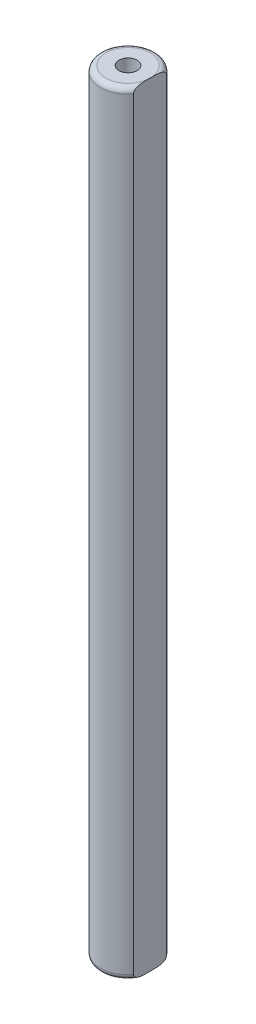
ISO-10303-21;
HEADER;
FILE_DESCRIPTION(('STEP AP214'),'2;1');
FILE_NAME('part.step','',(''),(''),'','','');
FILE_SCHEMA(('AUTOMOTIVE_DESIGN { 1 0 10303 214 1 1 1 1 }'));
ENDSEC;
DATA;
#1=APPLICATION_CONTEXT('core data for automotive mechanical design processes');
#2=APPLICATION_PROTOCOL_DEFINITION('international standard','automotive_design',2000,#1);
#3=PRODUCT_CONTEXT('',#1,'mechanical');
#4=PRODUCT('Part','Part','',(#3));
#5=PRODUCT_RELATED_PRODUCT_CATEGORY('part','',(#4));
#6=PRODUCT_DEFINITION_FORMATION('','',#4);
#7=PRODUCT_DEFINITION_CONTEXT('part definition',#1,'design');
#8=PRODUCT_DEFINITION('design','',#6,#7);
#9=PRODUCT_DEFINITION_SHAPE('','',#8);
#10=(LENGTH_UNIT() NAMED_UNIT(*) SI_UNIT(.MILLI.,.METRE.));
#11=(NAMED_UNIT(*) PLANE_ANGLE_UNIT() SI_UNIT($,.RADIAN.));
#12=(NAMED_UNIT(*) SI_UNIT($,.STERADIAN.) SOLID_ANGLE_UNIT());
#13=UNCERTAINTY_MEASURE_WITH_UNIT(LENGTH_MEASURE(1.E-05),#10,'distance_accuracy_value','');
#14=(GEOMETRIC_REPRESENTATION_CONTEXT(3) GLOBAL_UNCERTAINTY_ASSIGNED_CONTEXT((#13)) GLOBAL_UNIT_ASSIGNED_CONTEXT((#10,
#11,#12)) REPRESENTATION_CONTEXT('',''));
#15=CARTESIAN_POINT('',(0.,0.,0.));
#16=DIRECTION('',(0.,0.,1.));
#17=DIRECTION('',(1.,0.,0.));
#18=AXIS2_PLACEMENT_3D('',#15,#16,#17);
#19=CARTESIAN_POINT('',(0.,-35.15,0.));
#20=DIRECTION('',(0.,-1.,0.));
#21=DIRECTION('',(0.,0.,1.));
#22=AXIS2_PLACEMENT_3D('',#19,#20,#21);
#23=PLANE('',#22);
#24=CARTESIAN_POINT('',(0.,-35.15,0.));
#25=DIRECTION('',(0.,-1.,0.));
#26=DIRECTION('',(0.,0.,-1.));
#27=AXIS2_PLACEMENT_3D('',#24,#25,#26);
#28=CIRCLE('',#27,2.);
#29=CARTESIAN_POINT('',(2.,-35.15,0.));
#30=VERTEX_POINT('',#29);
#31=EDGE_CURVE('E11',#30,#30,#28,.T.);
#32=ORIENTED_EDGE('',*,*,#31,.T.);
#33=EDGE_LOOP('',(#32));
#34=FACE_BOUND('',#33,.T.);
#35=CARTESIAN_POINT('',(0.,-35.15,0.));
#36=DIRECTION('',(0.,1.,0.));
#37=DIRECTION('',(0.,0.,1.));
#38=AXIS2_PLACEMENT_3D('',#35,#36,#37);
#39=CIRCLE('',#38,0.825);
#40=CARTESIAN_POINT('',(0.,-35.15,0.825));
#41=VERTEX_POINT('',#40);
#42=EDGE_CURVE('E135',#41,#41,#39,.T.);
#43=ORIENTED_EDGE('',*,*,#42,.T.);
#44=EDGE_LOOP('',(#43));
#45=FACE_BOUND('',#44,.T.);
#46=ADVANCED_FACE('F35',(#34,#45),#23,.T.);
#47=CARTESIAN_POINT('',(0.,35.15,0.));
#48=DIRECTION('',(0.,-1.,0.));
#49=DIRECTION('',(0.,0.,-1.));
#50=AXIS2_PLACEMENT_3D('',#47,#48,#49);
#51=CYLINDRICAL_SURFACE('',#50,2.5);
#52=DIRECTION('',(0.,1.,0.));
#53=VECTOR('',#52,1.);
#54=CARTESIAN_POINT('',(2.,0.,-1.5));
#55=LINE('',#54,#53);
#56=CARTESIAN_POINT('',(2.,-34.65,-1.5));
#57=VERTEX_POINT('',#56);
#58=CARTESIAN_POINT('',(2.,34.65,-1.5));
#59=VERTEX_POINT('',#58);
#60=EDGE_CURVE('E82',#57,#59,#55,.T.);
#61=ORIENTED_EDGE('',*,*,#60,.F.);
#62=CARTESIAN_POINT('',(0.,-34.65,0.));
#63=DIRECTION('',(0.,-1.,0.));
#64=DIRECTION('',(0.,0.,-1.));
#65=AXIS2_PLACEMENT_3D('',#62,#63,#64);
#66=CIRCLE('',#65,2.5);
#67=CARTESIAN_POINT('',(2.,-34.65,1.5));
#68=VERTEX_POINT('',#67);
#69=EDGE_CURVE('E118',#57,#68,#66,.F.);
#70=ORIENTED_EDGE('',*,*,#69,.T.);
#71=DIRECTION('',(0.,1.,0.));
#72=VECTOR('',#71,1.);
#73=CARTESIAN_POINT('',(2.,0.,1.5));
#74=LINE('',#73,#72);
#75=CARTESIAN_POINT('',(2.,34.65,1.5));
#76=VERTEX_POINT('',#75);
#77=EDGE_CURVE('E123',#68,#76,#74,.T.);
#78=ORIENTED_EDGE('',*,*,#77,.T.);
#79=CARTESIAN_POINT('',(0.,34.65,0.));
#80=DIRECTION('',(0.,1.,0.));
#81=DIRECTION('',(0.,0.,1.));
#82=AXIS2_PLACEMENT_3D('',#79,#80,#81);
#83=CIRCLE('',#82,2.5);
#84=EDGE_CURVE('E77',#76,#59,#83,.F.);
#85=ORIENTED_EDGE('',*,*,#84,.T.);
#86=EDGE_LOOP('',(#61,#70,#78,#85));
#87=FACE_BOUND('',#86,.T.);
#88=ADVANCED_FACE('F154',(#87),#51,.T.);
#89=CARTESIAN_POINT('',(0.,35.15,0.));
#90=DIRECTION('',(0.,1.,0.));
#91=DIRECTION('',(0.,0.,1.));
#92=AXIS2_PLACEMENT_3D('',#89,#90,#91);
#93=PLANE('',#92);
#94=CARTESIAN_POINT('',(0.,35.15,0.));
#95=DIRECTION('',(0.,1.,0.));
#96=DIRECTION('',(0.,0.,1.));
#97=AXIS2_PLACEMENT_3D('',#94,#95,#96);
#98=CIRCLE('',#97,2.);
#99=CARTESIAN_POINT('',(2.,35.15,0.));
#100=VERTEX_POINT('',#99);
#101=EDGE_CURVE('E75',#100,#100,#98,.T.);
#102=ORIENTED_EDGE('',*,*,#101,.T.);
#103=EDGE_LOOP('',(#102));
#104=FACE_BOUND('',#103,.T.);
#105=CARTESIAN_POINT('',(0.,35.15,0.));
#106=DIRECTION('',(0.,1.,0.));
#107=DIRECTION('',(0.,0.,1.));
#108=AXIS2_PLACEMENT_3D('',#105,#106,#107);
#109=CIRCLE('',#108,0.825);
#110=CARTESIAN_POINT('',(0.,35.15,0.825));
#111=VERTEX_POINT('',#110);
#112=EDGE_CURVE('E90',#111,#111,#109,.T.);
#113=ORIENTED_EDGE('',*,*,#112,.F.);
#114=EDGE_LOOP('',(#113));
#115=FACE_BOUND('',#114,.T.);
#116=ADVANCED_FACE('F85',(#104,#115),#93,.T.);
#117=CARTESIAN_POINT('',(0.,30.15,0.));
#118=DIRECTION('',(0.,1.,0.));
#119=DIRECTION('',(0.,0.,1.));
#120=AXIS2_PLACEMENT_3D('',#117,#118,#119);
#121=CYLINDRICAL_SURFACE('',#120,0.825);
#122=CARTESIAN_POINT('',(0.,30.15,0.));
#123=DIRECTION('',(0.,1.,0.));
#124=DIRECTION('',(0.,0.,1.));
#125=AXIS2_PLACEMENT_3D('',#122,#123,#124);
#126=CIRCLE('',#125,0.825);
#127=CARTESIAN_POINT('',(0.,30.15,0.825));
#128=VERTEX_POINT('',#127);
#129=EDGE_CURVE('E87',#128,#128,#126,.T.);
#130=ORIENTED_EDGE('',*,*,#129,.F.);
#131=EDGE_LOOP('',(#130));
#132=FACE_BOUND('',#131,.T.);
#133=ORIENTED_EDGE('',*,*,#112,.T.);
#134=EDGE_LOOP('',(#133));
#135=FACE_BOUND('',#134,.T.);
#136=ADVANCED_FACE('F161',(#132,#135),#121,.F.);
#137=CARTESIAN_POINT('',(0.,30.15,0.));
#138=DIRECTION('',(0.,1.,0.));
#139=DIRECTION('',(0.,0.,1.));
#140=AXIS2_PLACEMENT_3D('',#137,#138,#139);
#141=PLANE('',#140);
#142=ORIENTED_EDGE('',*,*,#129,.T.);
#143=EDGE_LOOP('',(#142));
#144=FACE_BOUND('',#143,.T.);
#145=ADVANCED_FACE('F107',(#144),#141,.T.);
#146=CARTESIAN_POINT('',(2.,0.,-1.5));
#147=DIRECTION('',(-1.,0.,0.));
#148=DIRECTION('',(0.,0.,1.));
#149=AXIS2_PLACEMENT_3D('',#146,#147,#148);
#150=PLANE('',#149);
#151=ORIENTED_EDGE('',*,*,#77,.F.);
#152=CARTESIAN_POINT('',(2.,-34.65,1.5));
#153=CARTESIAN_POINT('',(2.,-34.6700065150284,1.50005508764519));
#154=CARTESIAN_POINT('',(2.,-34.6899505223803,1.49800297503596));
#155=CARTESIAN_POINT('',(2.,-34.7288908622129,1.49017103135305));
#156=CARTESIAN_POINT('',(2.,-34.747894786355,1.48442943896433));
#157=CARTESIAN_POINT('',(2.,-34.7845007170815,1.46971395516311));
#158=CARTESIAN_POINT('',(2.,-34.8021074472319,1.46075157527048));
#159=CARTESIAN_POINT('',(2.,-34.8357418270519,1.44018960181346));
#160=CARTESIAN_POINT('',(2.,-34.8517650844176,1.42858295243752));
#161=CARTESIAN_POINT('',(2.,-34.8889337995344,1.39760924057378));
#162=CARTESIAN_POINT('',(2.,-34.9091275913188,1.37710380043444));
#163=CARTESIAN_POINT('',(2.,-34.9460193785026,1.3332153788633));
#164=CARTESIAN_POINT('',(2.,-34.9627135559447,1.30982929844171));
#165=CARTESIAN_POINT('',(2.,-35.0025266059827,1.24588475655888));
#166=CARTESIAN_POINT('',(2.,-35.0231102761167,1.20375339504331));
#167=CARTESIAN_POINT('',(2.,-35.0492657628372,1.13857481760512));
#168=CARTESIAN_POINT('',(2.,-35.0572271665565,1.11639476146754));
#169=CARTESIAN_POINT('',(2.,-35.0717347834849,1.07158652733004));
#170=CARTESIAN_POINT('',(2.,-35.0782820228324,1.04895868735181));
#171=CARTESIAN_POINT('',(2.,-35.0954775535542,0.982989447767375));
#172=CARTESIAN_POINT('',(2.,-35.1045494991958,0.939240813702868));
#173=CARTESIAN_POINT('',(2.,-35.1194389319571,0.85118057519475));
#174=CARTESIAN_POINT('',(2.,-35.1252529100803,0.806868416119317));
#175=CARTESIAN_POINT('',(2.,-35.1345404183726,0.717748873858497));
#176=CARTESIAN_POINT('',(2.,-35.1380000262617,0.672940110398228));
#177=CARTESIAN_POINT('',(2.,-35.143276064899,0.583224127429996));
#178=CARTESIAN_POINT('',(2.,-35.1450920982067,0.53831688673903));
#179=CARTESIAN_POINT('',(2.,-35.1475884411658,0.45202717013826));
#180=CARTESIAN_POINT('',(2.,-35.148347176557,0.410646661478023));
#181=CARTESIAN_POINT('',(2.,-35.1493649293624,0.327877214900453));
#182=CARTESIAN_POINT('',(2.,-35.1496239046375,0.286488276566584));
#183=CARTESIAN_POINT('',(2.,-35.1499262759538,0.204245986253958));
#184=CARTESIAN_POINT('',(2.,-35.1499724201265,0.163392638975686));
#185=CARTESIAN_POINT('',(2.,-35.1499994454164,0.0816928216893292));
#186=CARTESIAN_POINT('',(2.,-35.1499803376138,0.0408463516913637));
#187=CARTESIAN_POINT('',(2.,-35.15,0.));
#188=B_SPLINE_CURVE_WITH_KNOTS('',3,(#152,#153,#154,#155,#156,#157,#158,#159,#160,#161,#162,
#163,#164,#165,#166,#167,#168,#169,#170,#171,#172,#173,#174,#175,#176,#177,#178,#179,#180,#181,
#182,#183,#184,#185,#186,#187),.UNSPECIFIED.,.F.,.F.,(4,2,2,2,2,2,2,2,2,2,2,2,2,2,2,2,2,4),(0.,
0.0598154823382477,0.119020807803606,0.178016596524454,0.237171689151979,0.323022405322567,
0.408966299732605,0.548800102010772,0.619474466309537,0.690097374684527,0.823948961414437,
0.957944437366601,1.09272554990601,1.22753924580541,1.35169671337948,1.47586464927862,
1.59842472260636,1.72096398530663),.UNSPECIFIED.);
#189=EDGE_CURVE('E44',#68,#30,#188,.T.);
#190=ORIENTED_EDGE('',*,*,#189,.T.);
#191=CARTESIAN_POINT('',(2.,-35.15,0.));
#192=CARTESIAN_POINT('',(2.,-35.149980484284,-0.0407626231076289));
#193=CARTESIAN_POINT('',(2.,-35.1499994433899,-0.0815253750922564));
#194=CARTESIAN_POINT('',(2.,-35.1499726519699,-0.163057529759021));
#195=CARTESIAN_POINT('',(2.,-35.1499268907924,-0.203826932431489));
#196=CARTESIAN_POINT('',(2.,-35.1496272394696,-0.285823216792328));
#197=CARTESIAN_POINT('',(2.,-35.1493710177251,-0.327050094241002));
#198=CARTESIAN_POINT('',(2.,-35.1483653267444,-0.409495794992682));
#199=CARTESIAN_POINT('',(2.,-35.1476158970779,-0.450714618676486));
#200=CARTESIAN_POINT('',(2.,-35.1452076449429,-0.534687159846425));
#201=CARTESIAN_POINT('',(2.,-35.1435155371863,-0.577440036322863));
#202=CARTESIAN_POINT('',(2.,-35.1386762279352,-0.662861842446352));
#203=CARTESIAN_POINT('',(2.,-35.1355293281928,-0.705530787660099));
#204=CARTESIAN_POINT('',(2.,-35.1271629448661,-0.790467964812873));
#205=CARTESIAN_POINT('',(2.,-35.1219534285849,-0.832737137282493));
#206=CARTESIAN_POINT('',(2.,-35.1087065375739,-0.916821134882455));
#207=CARTESIAN_POINT('',(2.,-35.1006717348777,-0.958636337716518));
#208=CARTESIAN_POINT('',(2.,-35.0868499282799,-1.01633423815903));
#209=CARTESIAN_POINT('',(2.,-35.0826447414506,-1.0325980627166));
#210=CARTESIAN_POINT('',(2.,-35.0735803939948,-1.06494846149724));
#211=CARTESIAN_POINT('',(2.,-35.0687209867408,-1.08103496638818));
#212=CARTESIAN_POINT('',(2.,-35.0530766101654,-1.12889043811801));
#213=CARTESIAN_POINT('',(2.,-35.0412104355907,-1.16032087149606));
#214=CARTESIAN_POINT('',(2.,-35.0138471087185,-1.22193787642586));
#215=CARTESIAN_POINT('',(2.,-34.9983172442343,-1.25211017751241));
#216=CARTESIAN_POINT('',(2.,-34.9629711649222,-1.30987180248264));
#217=CARTESIAN_POINT('',(2.,-34.9431618343013,-1.33746517402654));
#218=CARTESIAN_POINT('',(2.,-34.9063229296638,-1.37963467843693));
#219=CARTESIAN_POINT('',(2.,-34.890685118637,-1.39542133682361));
#220=CARTESIAN_POINT('',(2.,-34.8572261082969,-1.4245077100884));
#221=CARTESIAN_POINT('',(2.,-34.8394069701865,-1.43780974319198));
#222=CARTESIAN_POINT('',(2.,-34.8045634610992,-1.45935751669131));
#223=CARTESIAN_POINT('',(2.,-34.787825568107,-1.46806350146973));
#224=CARTESIAN_POINT('',(2.,-34.7531430315798,-1.48256312102217));
#225=CARTESIAN_POINT('',(2.,-34.7352009877708,-1.48836281472543));
#226=CARTESIAN_POINT('',(2.,-34.7059337018007,-1.49497096281988));
#227=CARTESIAN_POINT('',(2.,-34.6948421897842,-1.49684839330713));
#228=CARTESIAN_POINT('',(2.,-34.6725033908703,-1.49936626406293));
#229=CARTESIAN_POINT('',(2.,-34.6612558958349,-1.5000048503837));
#230=CARTESIAN_POINT('',(2.,-34.65,-1.5));
#231=B_SPLINE_CURVE_WITH_KNOTS('',3,(#191,#192,#193,#194,#195,#196,#197,#198,#199,#200,#201,
#202,#203,#204,#205,#206,#207,#208,#209,#210,#211,#212,#213,#214,#215,#216,#217,#218,#219,#220,
#221,#222,#223,#224,#225,#226,#227,#228,#229,#230),.UNSPECIFIED.,.F.,.F.,(4,2,2,2,2,2,2,2,2,2,2,
2,2,2,2,2,2,2,2,4),(0.,0.122288098502134,0.244596325308749,0.368278121933788,0.491949996900832,
0.620293921253729,0.74861123651507,0.876315899810972,1.00390460532892,1.05428854590096,
1.10469153363842,1.20529649885782,1.30683621704435,1.40821379274341,1.47468160162245,
1.54108708094666,1.5974625296124,1.65371995469663,1.68740390926937,1.72113823358774),.UNSPECIFIED.);
#232=EDGE_CURVE('E54',#30,#57,#231,.T.);
#233=ORIENTED_EDGE('',*,*,#232,.T.);
#234=ORIENTED_EDGE('',*,*,#60,.T.);
#235=CARTESIAN_POINT('',(2.,34.65,-1.5));
#236=CARTESIAN_POINT('',(2.,34.6700065150284,-1.50005508764519));
#237=CARTESIAN_POINT('',(2.,34.6899505223803,-1.49800297503596));
#238=CARTESIAN_POINT('',(2.,34.7288908622129,-1.49017103135305));
#239=CARTESIAN_POINT('',(2.,34.747894786355,-1.48442943896433));
#240=CARTESIAN_POINT('',(2.,34.7845007170815,-1.46971395516311));
#241=CARTESIAN_POINT('',(2.,34.8021074472319,-1.46075157527048));
#242=CARTESIAN_POINT('',(2.,34.8357418270519,-1.44018960181346));
#243=CARTESIAN_POINT('',(2.,34.8517650844176,-1.42858295243752));
#244=CARTESIAN_POINT('',(2.,34.8889337995344,-1.39760924057378));
#245=CARTESIAN_POINT('',(2.,34.9091275913188,-1.37710380043444));
#246=CARTESIAN_POINT('',(2.,34.9460193785026,-1.3332153788633));
#247=CARTESIAN_POINT('',(2.,34.9627135559447,-1.30982929844171));
#248=CARTESIAN_POINT('',(2.,35.0025266059827,-1.24588475655888));
#249=CARTESIAN_POINT('',(2.,35.0231102761167,-1.20375339504331));
#250=CARTESIAN_POINT('',(2.,35.0492657628372,-1.13857481760512));
#251=CARTESIAN_POINT('',(2.,35.0572271665565,-1.11639476146754));
#252=CARTESIAN_POINT('',(2.,35.0717347834849,-1.07158652733004));
#253=CARTESIAN_POINT('',(2.,35.0782820228324,-1.04895868735181));
#254=CARTESIAN_POINT('',(2.,35.0954775535542,-0.982989447767375));
#255=CARTESIAN_POINT('',(2.,35.1045494991958,-0.939240813702868));
#256=CARTESIAN_POINT('',(2.,35.1194389319571,-0.85118057519475));
#257=CARTESIAN_POINT('',(2.,35.1252529100803,-0.806868416119317));
#258=CARTESIAN_POINT('',(2.,35.1345404183726,-0.717748873858497));
#259=CARTESIAN_POINT('',(2.,35.1380000262617,-0.672940110398228));
#260=CARTESIAN_POINT('',(2.,35.143276064899,-0.583224127429996));
#261=CARTESIAN_POINT('',(2.,35.1450920982067,-0.53831688673903));
#262=CARTESIAN_POINT('',(2.,35.1475884411658,-0.45202717013826));
#263=CARTESIAN_POINT('',(2.,35.148347176557,-0.410646661478023));
#264=CARTESIAN_POINT('',(2.,35.1493649293624,-0.327877214900453));
#265=CARTESIAN_POINT('',(2.,35.1496239046375,-0.286488276566584));
#266=CARTESIAN_POINT('',(2.,35.1499262759538,-0.204245986253958));
#267=CARTESIAN_POINT('',(2.,35.1499724201265,-0.163392638975686));
#268=CARTESIAN_POINT('',(2.,35.1499994454164,-0.0816928216893292));
#269=CARTESIAN_POINT('',(2.,35.1499803376138,-0.0408463516913637));
#270=CARTESIAN_POINT('',(2.,35.15,0.));
#271=B_SPLINE_CURVE_WITH_KNOTS('',3,(#235,#236,#237,#238,#239,#240,#241,#242,#243,#244,#245,
#246,#247,#248,#249,#250,#251,#252,#253,#254,#255,#256,#257,#258,#259,#260,#261,#262,#263,#264,
#265,#266,#267,#268,#269,#270),.UNSPECIFIED.,.F.,.F.,(4,2,2,2,2,2,2,2,2,2,2,2,2,2,2,2,2,4),(0.,
0.0598154823382477,0.119020807803606,0.178016596524454,0.237171689151979,0.323022405322567,
0.408966299732605,0.548800102010772,0.619474466309537,0.690097374684527,0.823948961414437,
0.957944437366601,1.09272554990601,1.22753924580541,1.35169671337948,1.47586464927862,
1.59842472260636,1.72096398530663),.UNSPECIFIED.);
#272=EDGE_CURVE('E79',#59,#100,#271,.T.);
#273=ORIENTED_EDGE('',*,*,#272,.T.);
#274=CARTESIAN_POINT('',(2.,35.15,0.));
#275=CARTESIAN_POINT('',(2.,35.149980484284,0.0407626231076289));
#276=CARTESIAN_POINT('',(2.,35.1499994433899,0.0815253750922564));
#277=CARTESIAN_POINT('',(2.,35.1499726519699,0.163057529759021));
#278=CARTESIAN_POINT('',(2.,35.1499268907924,0.203826932431489));
#279=CARTESIAN_POINT('',(2.,35.1496272394696,0.285823216792328));
#280=CARTESIAN_POINT('',(2.,35.1493710177251,0.327050094241002));
#281=CARTESIAN_POINT('',(2.,35.1483653267444,0.409495794992682));
#282=CARTESIAN_POINT('',(2.,35.1476158970779,0.450714618676486));
#283=CARTESIAN_POINT('',(2.,35.1452076449429,0.534687159846425));
#284=CARTESIAN_POINT('',(2.,35.1435155371863,0.577440036322863));
#285=CARTESIAN_POINT('',(2.,35.1386762279352,0.662861842446352));
#286=CARTESIAN_POINT('',(2.,35.1355293281928,0.705530787660099));
#287=CARTESIAN_POINT('',(2.,35.1271629448661,0.790467964812873));
#288=CARTESIAN_POINT('',(2.,35.1219534285849,0.832737137282493));
#289=CARTESIAN_POINT('',(2.,35.1087065375739,0.916821134882455));
#290=CARTESIAN_POINT('',(2.,35.1006717348777,0.958636337716518));
#291=CARTESIAN_POINT('',(2.,35.0868499282799,1.01633423815903));
#292=CARTESIAN_POINT('',(2.,35.0826447414506,1.0325980627166));
#293=CARTESIAN_POINT('',(2.,35.0735803939948,1.06494846149724));
#294=CARTESIAN_POINT('',(2.,35.0687209867408,1.08103496638818));
#295=CARTESIAN_POINT('',(2.,35.0530766101654,1.12889043811801));
#296=CARTESIAN_POINT('',(2.,35.0412104355907,1.16032087149606));
#297=CARTESIAN_POINT('',(2.,35.0138471087185,1.22193787642586));
#298=CARTESIAN_POINT('',(2.,34.9983172442343,1.25211017751241));
#299=CARTESIAN_POINT('',(2.,34.9629711649222,1.30987180248264));
#300=CARTESIAN_POINT('',(2.,34.9431618343013,1.33746517402654));
#301=CARTESIAN_POINT('',(2.,34.9063229296638,1.37963467843693));
#302=CARTESIAN_POINT('',(2.,34.890685118637,1.39542133682361));
#303=CARTESIAN_POINT('',(2.,34.8572261082969,1.4245077100884));
#304=CARTESIAN_POINT('',(2.,34.8394069701865,1.43780974319198));
#305=CARTESIAN_POINT('',(2.,34.8045634610992,1.45935751669131));
#306=CARTESIAN_POINT('',(2.,34.787825568107,1.46806350146973));
#307=CARTESIAN_POINT('',(2.,34.7531430315798,1.48256312102217));
#308=CARTESIAN_POINT('',(2.,34.7352009877708,1.48836281472543));
#309=CARTESIAN_POINT('',(2.,34.7059337018007,1.49497096281988));
#310=CARTESIAN_POINT('',(2.,34.6948421897842,1.49684839330713));
#311=CARTESIAN_POINT('',(2.,34.6725033908703,1.49936626406293));
#312=CARTESIAN_POINT('',(2.,34.6612558958349,1.5000048503837));
#313=CARTESIAN_POINT('',(2.,34.65,1.5));
#314=B_SPLINE_CURVE_WITH_KNOTS('',3,(#274,#275,#276,#277,#278,#279,#280,#281,#282,#283,#284,
#285,#286,#287,#288,#289,#290,#291,#292,#293,#294,#295,#296,#297,#298,#299,#300,#301,#302,#303,
#304,#305,#306,#307,#308,#309,#310,#311,#312,#313),.UNSPECIFIED.,.F.,.F.,(4,2,2,2,2,2,2,2,2,2,2,
2,2,2,2,2,2,2,2,4),(0.,0.122288098502134,0.244596325308749,0.368278121933788,0.491949996900832,
0.620293921253729,0.74861123651507,0.876315899810972,1.00390460532892,1.05428854590096,
1.10469153363842,1.20529649885782,1.30683621704435,1.40821379274341,1.47468160162245,
1.54108708094666,1.5974625296124,1.65371995469663,1.68740390926937,1.72113823358774),.UNSPECIFIED.);
#315=EDGE_CURVE('E70',#100,#76,#314,.T.);
#316=ORIENTED_EDGE('',*,*,#315,.T.);
#317=EDGE_LOOP('',(#151,#190,#233,#234,#273,#316));
#318=FACE_BOUND('',#317,.T.);
#319=ADVANCED_FACE('F81',(#318),#150,.F.);
#320=CARTESIAN_POINT('',(0.,34.65,0.));
#321=DIRECTION('',(0.,1.,0.));
#322=DIRECTION('',(0.,0.,1.));
#323=AXIS2_PLACEMENT_3D('',#320,#321,#322);
#324=TOROIDAL_SURFACE('',#323,2.,0.5);
#325=ORIENTED_EDGE('',*,*,#272,.F.);
#326=ORIENTED_EDGE('',*,*,#84,.F.);
#327=ORIENTED_EDGE('',*,*,#315,.F.);
#328=ORIENTED_EDGE('',*,*,#101,.F.);
#329=EDGE_LOOP('',(#325,#326,#327,#328));
#330=FACE_BOUND('',#329,.T.);
#331=ADVANCED_FACE('F73',(#330),#324,.T.);
#332=CARTESIAN_POINT('',(0.,-30.15,0.));
#333=DIRECTION('',(0.,-1.,0.));
#334=DIRECTION('',(0.,0.,-1.));
#335=AXIS2_PLACEMENT_3D('',#332,#333,#334);
#336=CYLINDRICAL_SURFACE('',#335,0.825);
#337=CARTESIAN_POINT('',(0.,-30.15,0.));
#338=DIRECTION('',(0.,1.,0.));
#339=DIRECTION('',(0.,0.,1.));
#340=AXIS2_PLACEMENT_3D('',#337,#338,#339);
#341=CIRCLE('',#340,0.825);
#342=CARTESIAN_POINT('',(0.,-30.15,0.825));
#343=VERTEX_POINT('',#342);
#344=EDGE_CURVE('E133',#343,#343,#341,.T.);
#345=ORIENTED_EDGE('',*,*,#344,.T.);
#346=EDGE_LOOP('',(#345));
#347=FACE_BOUND('',#346,.T.);
#348=ORIENTED_EDGE('',*,*,#42,.F.);
#349=EDGE_LOOP('',(#348));
#350=FACE_BOUND('',#349,.T.);
#351=ADVANCED_FACE('F144',(#347,#350),#336,.F.);
#352=CARTESIAN_POINT('',(0.,-30.15,0.));
#353=DIRECTION('',(0.,-1.,0.));
#354=DIRECTION('',(0.,0.,1.));
#355=AXIS2_PLACEMENT_3D('',#352,#353,#354);
#356=PLANE('',#355);
#357=ORIENTED_EDGE('',*,*,#344,.F.);
#358=EDGE_LOOP('',(#357));
#359=FACE_BOUND('',#358,.T.);
#360=ADVANCED_FACE('F146',(#359),#356,.T.);
#361=CARTESIAN_POINT('',(0.,-34.65,0.));
#362=DIRECTION('',(0.,-1.,0.));
#363=DIRECTION('',(0.,0.,-1.));
#364=AXIS2_PLACEMENT_3D('',#361,#362,#363);
#365=TOROIDAL_SURFACE('',#364,2.,0.5);
#366=ORIENTED_EDGE('',*,*,#232,.F.);
#367=ORIENTED_EDGE('',*,*,#31,.F.);
#368=ORIENTED_EDGE('',*,*,#189,.F.);
#369=ORIENTED_EDGE('',*,*,#69,.F.);
#370=EDGE_LOOP('',(#366,#367,#368,#369));
#371=FACE_BOUND('',#370,.T.);
#372=ADVANCED_FACE('F37',(#371),#365,.T.);
#373=CLOSED_SHELL('',(#46,#88,#116,#136,#145,#319,#331,#351,#360,#372));
#374=MANIFOLD_SOLID_BREP('B2',#373);
#375=ADVANCED_BREP_SHAPE_REPRESENTATION('',(#18,#374),#14);
#376=SHAPE_DEFINITION_REPRESENTATION(#9,#375);
ENDSEC;
END-ISO-10303-21;
